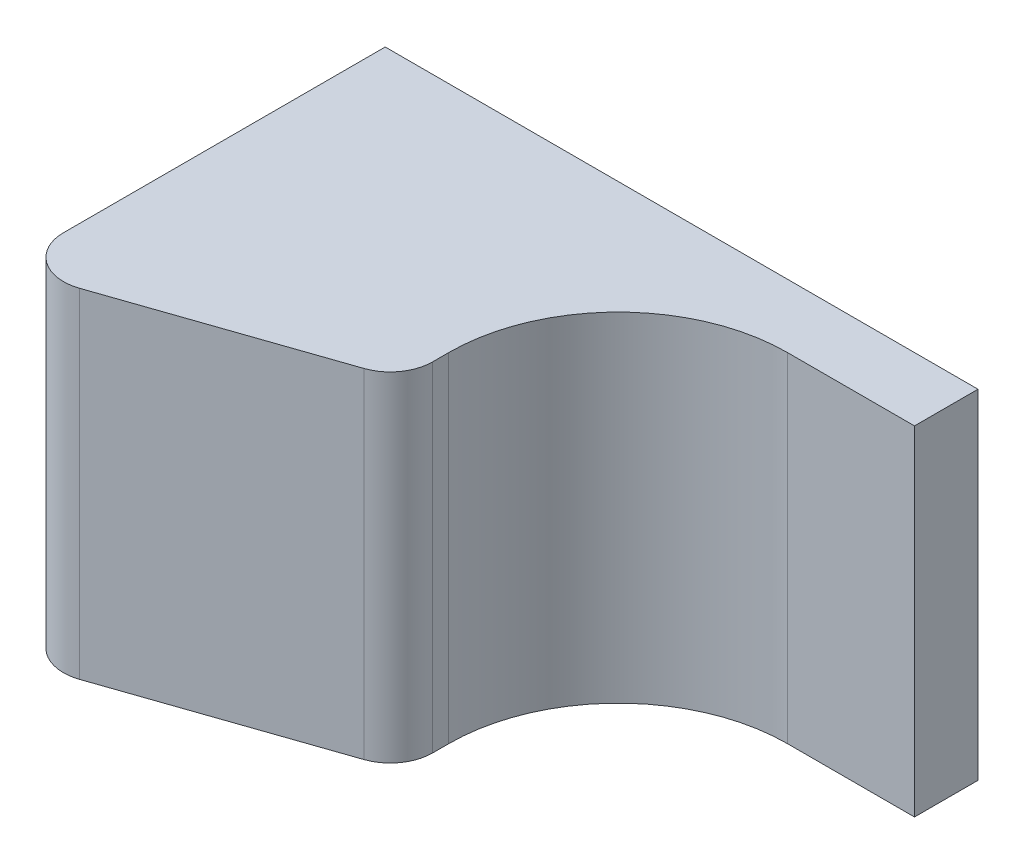
ISO-10303-21;
HEADER;
FILE_DESCRIPTION(('STEP AP214'),'2;1');
FILE_NAME('part.step','',(''),(''),'','','');
FILE_SCHEMA(('AUTOMOTIVE_DESIGN { 1 0 10303 214 1 1 1 1 }'));
ENDSEC;
DATA;
#1=APPLICATION_CONTEXT('core data for automotive mechanical design processes');
#2=APPLICATION_PROTOCOL_DEFINITION('international standard','automotive_design',2000,#1);
#3=PRODUCT_CONTEXT('',#1,'mechanical');
#4=PRODUCT('Part','Part','',(#3));
#5=PRODUCT_RELATED_PRODUCT_CATEGORY('part','',(#4));
#6=PRODUCT_DEFINITION_FORMATION('','',#4);
#7=PRODUCT_DEFINITION_CONTEXT('part definition',#1,'design');
#8=PRODUCT_DEFINITION('design','',#6,#7);
#9=PRODUCT_DEFINITION_SHAPE('','',#8);
#10=(LENGTH_UNIT() NAMED_UNIT(*) SI_UNIT(.MILLI.,.METRE.));
#11=(NAMED_UNIT(*) PLANE_ANGLE_UNIT() SI_UNIT($,.RADIAN.));
#12=(NAMED_UNIT(*) SI_UNIT($,.STERADIAN.) SOLID_ANGLE_UNIT());
#13=UNCERTAINTY_MEASURE_WITH_UNIT(LENGTH_MEASURE(1.E-05),#10,'distance_accuracy_value','');
#14=(GEOMETRIC_REPRESENTATION_CONTEXT(3) GLOBAL_UNCERTAINTY_ASSIGNED_CONTEXT((#13)) GLOBAL_UNIT_ASSIGNED_CONTEXT((#10,
#11,#12)) REPRESENTATION_CONTEXT('',''));
#15=CARTESIAN_POINT('',(0.,0.,0.));
#16=DIRECTION('',(0.,0.,1.));
#17=DIRECTION('',(1.,0.,0.));
#18=AXIS2_PLACEMENT_3D('',#15,#16,#17);
#19=CARTESIAN_POINT('',(7.,7.35,14.5));
#20=DIRECTION('',(-1.,0.,0.));
#21=DIRECTION('',(0.,0.,1.));
#22=AXIS2_PLACEMENT_3D('',#19,#20,#21);
#23=PLANE('',#22);
#24=DIRECTION('',(0.,0.,-1.));
#25=VECTOR('',#24,1.);
#26=CARTESIAN_POINT('',(7.,-0.649999999999996,14.5));
#27=LINE('',#26,#25);
#28=CARTESIAN_POINT('',(7.,-0.649999999999996,11.3800672302695));
#29=VERTEX_POINT('',#28);
#30=CARTESIAN_POINT('',(7.,-0.649999999999996,11.));
#31=VERTEX_POINT('',#30);
#32=EDGE_CURVE('E149',#29,#31,#27,.T.);
#33=ORIENTED_EDGE('',*,*,#32,.T.);
#34=DIRECTION('',(0.,-1.,0.));
#35=VECTOR('',#34,1.);
#36=CARTESIAN_POINT('',(7.,7.35,11.));
#37=LINE('',#36,#35);
#38=CARTESIAN_POINT('',(7.,7.35,11.));
#39=VERTEX_POINT('',#38);
#40=EDGE_CURVE('E54',#31,#39,#37,.F.);
#41=ORIENTED_EDGE('',*,*,#40,.T.);
#42=DIRECTION('',(0.,0.,-1.));
#43=VECTOR('',#42,1.);
#44=CARTESIAN_POINT('',(7.,7.35,14.5));
#45=LINE('',#44,#43);
#46=CARTESIAN_POINT('',(7.,7.35,11.3800672302695));
#47=VERTEX_POINT('',#46);
#48=EDGE_CURVE('E147',#47,#39,#45,.T.);
#49=ORIENTED_EDGE('',*,*,#48,.F.);
#50=DIRECTION('',(0.,1.,0.));
#51=VECTOR('',#50,1.);
#52=CARTESIAN_POINT('',(7.,7.35,11.3800672302695));
#53=LINE('',#52,#51);
#54=EDGE_CURVE('E169',#47,#29,#53,.F.);
#55=ORIENTED_EDGE('',*,*,#54,.T.);
#56=EDGE_LOOP('',(#33,#41,#49,#55));
#57=FACE_BOUND('',#56,.T.);
#58=ADVANCED_FACE('F33',(#57),#23,.F.);
#59=CARTESIAN_POINT('',(0.,7.35,14.5));
#60=DIRECTION('',(1.,0.,0.));
#61=DIRECTION('',(0.,1.,0.));
#62=AXIS2_PLACEMENT_3D('',#59,#60,#61);
#63=PLANE('',#62);
#64=DIRECTION('',(0.,0.,-1.));
#65=VECTOR('',#64,1.);
#66=CARTESIAN_POINT('',(0.,-0.649999999999997,14.5));
#67=LINE('',#66,#65);
#68=CARTESIAN_POINT('',(0.,-0.649999999999997,13.0988172302695));
#69=VERTEX_POINT('',#68);
#70=CARTESIAN_POINT('',(0.,-0.649999999999997,5.5));
#71=VERTEX_POINT('',#70);
#72=EDGE_CURVE('E151',#69,#71,#67,.T.);
#73=ORIENTED_EDGE('',*,*,#72,.F.);
#74=DIRECTION('',(0.,-1.,0.));
#75=VECTOR('',#74,1.);
#76=CARTESIAN_POINT('',(0.,7.35,13.0988172302695));
#77=LINE('',#76,#75);
#78=CARTESIAN_POINT('',(0.,7.35,13.0988172302695));
#79=VERTEX_POINT('',#78);
#80=EDGE_CURVE('E163',#69,#79,#77,.F.);
#81=ORIENTED_EDGE('',*,*,#80,.T.);
#82=DIRECTION('',(0.,0.,-1.));
#83=VECTOR('',#82,1.);
#84=CARTESIAN_POINT('',(0.,7.35,14.5));
#85=LINE('',#84,#83);
#86=CARTESIAN_POINT('',(0.,7.35,5.5));
#87=VERTEX_POINT('',#86);
#88=EDGE_CURVE('E115',#79,#87,#85,.T.);
#89=ORIENTED_EDGE('',*,*,#88,.T.);
#90=DIRECTION('',(0.,-1.,0.));
#91=VECTOR('',#90,1.);
#92=CARTESIAN_POINT('',(0.,7.35,5.5));
#93=LINE('',#92,#91);
#94=EDGE_CURVE('E112',#87,#71,#93,.T.);
#95=ORIENTED_EDGE('',*,*,#94,.T.);
#96=EDGE_LOOP('',(#73,#81,#89,#95));
#97=FACE_BOUND('',#96,.T.);
#98=ADVANCED_FACE('F184',(#97),#63,.F.);
#99=CARTESIAN_POINT('',(0.,-0.649999999999997,14.5));
#100=DIRECTION('',(0.,1.,0.));
#101=DIRECTION('',(-1.,0.,0.));
#102=AXIS2_PLACEMENT_3D('',#99,#100,#101);
#103=PLANE('',#102);
#104=DIRECTION('',(0.945686599304867,0.,-0.325079768511048));
#105=VECTOR('',#104,1.);
#106=CARTESIAN_POINT('',(16.,-0.649999999999994,9.));
#107=LINE('',#106,#105);
#108=CARTESIAN_POINT('',(1.32507976851105,-0.649999999999997,14.0445038295743));
#109=VERTEX_POINT('',#108);
#110=CARTESIAN_POINT('',(6.32507976851105,-0.649999999999996,12.3257538295743));
#111=VERTEX_POINT('',#110);
#112=EDGE_CURVE('E141',#109,#111,#107,.T.);
#113=ORIENTED_EDGE('',*,*,#112,.F.);
#114=CARTESIAN_POINT('',(1.,-0.649999999999998,13.0988172302695));
#115=DIRECTION('',(0.,1.,0.));
#116=DIRECTION('',(-1.,0.,0.));
#117=AXIS2_PLACEMENT_3D('',#114,#115,#116);
#118=CIRCLE('',#117,1.);
#119=EDGE_CURVE('E161',#109,#69,#118,.F.);
#120=ORIENTED_EDGE('',*,*,#119,.T.);
#121=ORIENTED_EDGE('',*,*,#72,.T.);
#122=DIRECTION('',(1.,0.,0.));
#123=VECTOR('',#122,1.);
#124=CARTESIAN_POINT('',(0.,-0.649999999999997,5.5));
#125=LINE('',#124,#123);
#126=CARTESIAN_POINT('',(14.,-0.649999999999996,5.5));
#127=VERTEX_POINT('',#126);
#128=EDGE_CURVE('E116',#71,#127,#125,.T.);
#129=ORIENTED_EDGE('',*,*,#128,.T.);
#130=DIRECTION('',(0.,0.,-1.));
#131=VECTOR('',#130,1.);
#132=CARTESIAN_POINT('',(14.,-0.649999999999996,5.5));
#133=LINE('',#132,#131);
#134=CARTESIAN_POINT('',(14.,-0.649999999999996,7.));
#135=VERTEX_POINT('',#134);
#136=EDGE_CURVE('E130',#135,#127,#133,.T.);
#137=ORIENTED_EDGE('',*,*,#136,.F.);
#138=DIRECTION('',(-1.,0.,0.));
#139=VECTOR('',#138,1.);
#140=CARTESIAN_POINT('',(14.,-0.649999999999996,7.));
#141=LINE('',#140,#139);
#142=CARTESIAN_POINT('',(11.,-0.649999999999996,7.));
#143=VERTEX_POINT('',#142);
#144=EDGE_CURVE('E135',#135,#143,#141,.T.);
#145=ORIENTED_EDGE('',*,*,#144,.T.);
#146=CARTESIAN_POINT('',(11.,-0.649999999999996,11.));
#147=DIRECTION('',(0.,1.,0.));
#148=DIRECTION('',(-1.,0.,0.));
#149=AXIS2_PLACEMENT_3D('',#146,#147,#148);
#150=CIRCLE('',#149,4.);
#151=EDGE_CURVE('E41',#143,#31,#150,.T.);
#152=ORIENTED_EDGE('',*,*,#151,.T.);
#153=ORIENTED_EDGE('',*,*,#32,.F.);
#154=CARTESIAN_POINT('',(6.,-0.649999999999998,11.3800672302695));
#155=DIRECTION('',(0.,1.,0.));
#156=DIRECTION('',(-1.,0.,0.));
#157=AXIS2_PLACEMENT_3D('',#154,#155,#156);
#158=CIRCLE('',#157,1.);
#159=EDGE_CURVE('E159',#29,#111,#158,.F.);
#160=ORIENTED_EDGE('',*,*,#159,.T.);
#161=EDGE_LOOP('',(#113,#120,#121,#129,#137,#145,#152,#153,#160));
#162=FACE_BOUND('',#161,.T.);
#163=ADVANCED_FACE('F181',(#162),#103,.F.);
#164=CARTESIAN_POINT('',(0.,7.35,14.5));
#165=DIRECTION('',(0.,-1.,0.));
#166=DIRECTION('',(0.,0.,-1.));
#167=AXIS2_PLACEMENT_3D('',#164,#165,#166);
#168=PLANE('',#167);
#169=ORIENTED_EDGE('',*,*,#88,.F.);
#170=CARTESIAN_POINT('',(1.,7.35,13.0988172302695));
#171=DIRECTION('',(0.,-1.,0.));
#172=DIRECTION('',(0.,0.,-1.));
#173=AXIS2_PLACEMENT_3D('',#170,#171,#172);
#174=CIRCLE('',#173,1.);
#175=CARTESIAN_POINT('',(1.32507976851105,7.35,14.0445038295743));
#176=VERTEX_POINT('',#175);
#177=EDGE_CURVE('E167',#79,#176,#174,.F.);
#178=ORIENTED_EDGE('',*,*,#177,.T.);
#179=DIRECTION('',(-0.945686599304867,0.,0.325079768511048));
#180=VECTOR('',#179,1.);
#181=CARTESIAN_POINT('',(16.,7.35,9.));
#182=LINE('',#181,#180);
#183=CARTESIAN_POINT('',(6.32507976851105,7.35,12.3257538295743));
#184=VERTEX_POINT('',#183);
#185=EDGE_CURVE('E138',#184,#176,#182,.T.);
#186=ORIENTED_EDGE('',*,*,#185,.F.);
#187=CARTESIAN_POINT('',(6.,7.35,11.3800672302695));
#188=DIRECTION('',(0.,-1.,0.));
#189=DIRECTION('',(0.,0.,-1.));
#190=AXIS2_PLACEMENT_3D('',#187,#188,#189);
#191=CIRCLE('',#190,1.);
#192=EDGE_CURVE('E165',#184,#47,#191,.F.);
#193=ORIENTED_EDGE('',*,*,#192,.T.);
#194=ORIENTED_EDGE('',*,*,#48,.T.);
#195=CARTESIAN_POINT('',(11.,7.35,11.));
#196=DIRECTION('',(0.,-1.,0.));
#197=DIRECTION('',(0.,0.,-1.));
#198=AXIS2_PLACEMENT_3D('',#195,#196,#197);
#199=CIRCLE('',#198,4.);
#200=CARTESIAN_POINT('',(11.,7.35,7.));
#201=VERTEX_POINT('',#200);
#202=EDGE_CURVE('E11',#39,#201,#199,.T.);
#203=ORIENTED_EDGE('',*,*,#202,.T.);
#204=DIRECTION('',(-1.,0.,0.));
#205=VECTOR('',#204,1.);
#206=CARTESIAN_POINT('',(14.,7.35,7.));
#207=LINE('',#206,#205);
#208=CARTESIAN_POINT('',(14.,7.35,7.));
#209=VERTEX_POINT('',#208);
#210=EDGE_CURVE('E122',#209,#201,#207,.T.);
#211=ORIENTED_EDGE('',*,*,#210,.F.);
#212=DIRECTION('',(0.,0.,1.));
#213=VECTOR('',#212,1.);
#214=CARTESIAN_POINT('',(14.,7.35,5.5));
#215=LINE('',#214,#213);
#216=CARTESIAN_POINT('',(14.,7.35,5.5));
#217=VERTEX_POINT('',#216);
#218=EDGE_CURVE('E119',#217,#209,#215,.T.);
#219=ORIENTED_EDGE('',*,*,#218,.F.);
#220=DIRECTION('',(-1.,0.,0.));
#221=VECTOR('',#220,1.);
#222=CARTESIAN_POINT('',(0.,7.35,5.5));
#223=LINE('',#222,#221);
#224=EDGE_CURVE('E105',#217,#87,#223,.T.);
#225=ORIENTED_EDGE('',*,*,#224,.T.);
#226=EDGE_LOOP('',(#169,#178,#186,#193,#194,#203,#211,#219,#225));
#227=FACE_BOUND('',#226,.T.);
#228=ADVANCED_FACE('F120',(#227),#168,.F.);
#229=CARTESIAN_POINT('',(0.,0.,5.5));
#230=DIRECTION('',(0.,0.,1.));
#231=DIRECTION('',(1.,0.,0.));
#232=AXIS2_PLACEMENT_3D('',#229,#230,#231);
#233=PLANE('',#232);
#234=ORIENTED_EDGE('',*,*,#94,.F.);
#235=ORIENTED_EDGE('',*,*,#224,.F.);
#236=DIRECTION('',(0.,1.,0.));
#237=VECTOR('',#236,1.);
#238=CARTESIAN_POINT('',(14.,7.35,5.5));
#239=LINE('',#238,#237);
#240=EDGE_CURVE('E110',#127,#217,#239,.T.);
#241=ORIENTED_EDGE('',*,*,#240,.F.);
#242=ORIENTED_EDGE('',*,*,#128,.F.);
#243=EDGE_LOOP('',(#234,#235,#241,#242));
#244=FACE_BOUND('',#243,.T.);
#245=ADVANCED_FACE('F107',(#244),#233,.F.);
#246=CARTESIAN_POINT('',(16.,-23.501,9.));
#247=DIRECTION('',(-0.325079768511048,0.,-0.945686599304867));
#248=DIRECTION('',(-0.945686599304867,0.,0.325079768511048));
#249=AXIS2_PLACEMENT_3D('',#246,#247,#248);
#250=PLANE('',#249);
#251=ORIENTED_EDGE('',*,*,#185,.T.);
#252=DIRECTION('',(0.,-1.,0.));
#253=VECTOR('',#252,1.);
#254=CARTESIAN_POINT('',(1.32507976851104,-23.501,14.0445038295743));
#255=LINE('',#254,#253);
#256=EDGE_CURVE('E156',#176,#109,#255,.T.);
#257=ORIENTED_EDGE('',*,*,#256,.T.);
#258=ORIENTED_EDGE('',*,*,#112,.T.);
#259=DIRECTION('',(0.,1.,0.));
#260=VECTOR('',#259,1.);
#261=CARTESIAN_POINT('',(6.32507976851105,-23.501,12.3257538295743));
#262=LINE('',#261,#260);
#263=EDGE_CURVE('E153',#111,#184,#262,.T.);
#264=ORIENTED_EDGE('',*,*,#263,.T.);
#265=EDGE_LOOP('',(#251,#257,#258,#264));
#266=FACE_BOUND('',#265,.T.);
#267=ADVANCED_FACE('F192',(#266),#250,.F.);
#268=CARTESIAN_POINT('',(0.999999999999992,-23.501,13.0988172302695));
#269=DIRECTION('',(0.,-1.,0.));
#270=DIRECTION('',(1.,0.,0.));
#271=AXIS2_PLACEMENT_3D('',#268,#269,#270);
#272=CYLINDRICAL_SURFACE('',#271,1.);
#273=ORIENTED_EDGE('',*,*,#177,.F.);
#274=ORIENTED_EDGE('',*,*,#80,.F.);
#275=ORIENTED_EDGE('',*,*,#119,.F.);
#276=ORIENTED_EDGE('',*,*,#256,.F.);
#277=EDGE_LOOP('',(#273,#274,#275,#276));
#278=FACE_BOUND('',#277,.T.);
#279=ADVANCED_FACE('F190',(#278),#272,.T.);
#280=CARTESIAN_POINT('',(6.,-23.501,11.3800672302695));
#281=DIRECTION('',(0.,1.,0.));
#282=DIRECTION('',(0.,0.,1.));
#283=AXIS2_PLACEMENT_3D('',#280,#281,#282);
#284=CYLINDRICAL_SURFACE('',#283,1.);
#285=ORIENTED_EDGE('',*,*,#159,.F.);
#286=ORIENTED_EDGE('',*,*,#54,.F.);
#287=ORIENTED_EDGE('',*,*,#192,.F.);
#288=ORIENTED_EDGE('',*,*,#263,.F.);
#289=EDGE_LOOP('',(#285,#286,#287,#288));
#290=FACE_BOUND('',#289,.T.);
#291=ADVANCED_FACE('F197',(#290),#284,.T.);
#292=CARTESIAN_POINT('',(14.,7.35,7.));
#293=DIRECTION('',(0.,0.,-1.));
#294=DIRECTION('',(0.,1.,0.));
#295=AXIS2_PLACEMENT_3D('',#292,#293,#294);
#296=PLANE('',#295);
#297=ORIENTED_EDGE('',*,*,#210,.T.);
#298=DIRECTION('',(0.,-1.,0.));
#299=VECTOR('',#298,1.);
#300=CARTESIAN_POINT('',(11.,-0.649999999999996,7.));
#301=LINE('',#300,#299);
#302=EDGE_CURVE('E171',#201,#143,#301,.T.);
#303=ORIENTED_EDGE('',*,*,#302,.T.);
#304=ORIENTED_EDGE('',*,*,#144,.F.);
#305=DIRECTION('',(0.,-1.,0.));
#306=VECTOR('',#305,1.);
#307=CARTESIAN_POINT('',(14.,7.35,7.));
#308=LINE('',#307,#306);
#309=EDGE_CURVE('E125',#209,#135,#308,.T.);
#310=ORIENTED_EDGE('',*,*,#309,.F.);
#311=EDGE_LOOP('',(#297,#303,#304,#310));
#312=FACE_BOUND('',#311,.T.);
#313=ADVANCED_FACE('F177',(#312),#296,.F.);
#314=CARTESIAN_POINT('',(14.,0.,0.));
#315=DIRECTION('',(-1.,0.,0.));
#316=DIRECTION('',(0.,0.,1.));
#317=AXIS2_PLACEMENT_3D('',#314,#315,#316);
#318=PLANE('',#317);
#319=ORIENTED_EDGE('',*,*,#240,.T.);
#320=ORIENTED_EDGE('',*,*,#218,.T.);
#321=ORIENTED_EDGE('',*,*,#309,.T.);
#322=ORIENTED_EDGE('',*,*,#136,.T.);
#323=EDGE_LOOP('',(#319,#320,#321,#322));
#324=FACE_BOUND('',#323,.T.);
#325=ADVANCED_FACE('F128',(#324),#318,.F.);
#326=CARTESIAN_POINT('',(11.,7.35,11.));
#327=DIRECTION('',(0.,1.,0.));
#328=DIRECTION('',(0.,0.,1.));
#329=AXIS2_PLACEMENT_3D('',#326,#327,#328);
#330=CYLINDRICAL_SURFACE('',#329,4.);
#331=ORIENTED_EDGE('',*,*,#202,.F.);
#332=ORIENTED_EDGE('',*,*,#40,.F.);
#333=ORIENTED_EDGE('',*,*,#151,.F.);
#334=ORIENTED_EDGE('',*,*,#302,.F.);
#335=EDGE_LOOP('',(#331,#332,#333,#334));
#336=FACE_BOUND('',#335,.T.);
#337=ADVANCED_FACE('F35',(#336),#330,.F.);
#338=CLOSED_SHELL('',(#58,#98,#163,#228,#245,#267,#279,#291,#313,#325,#337));
#339=MANIFOLD_SOLID_BREP('B2',#338);
#340=ADVANCED_BREP_SHAPE_REPRESENTATION('',(#18,#339),#14);
#341=SHAPE_DEFINITION_REPRESENTATION(#9,#340);
ENDSEC;
END-ISO-10303-21;
